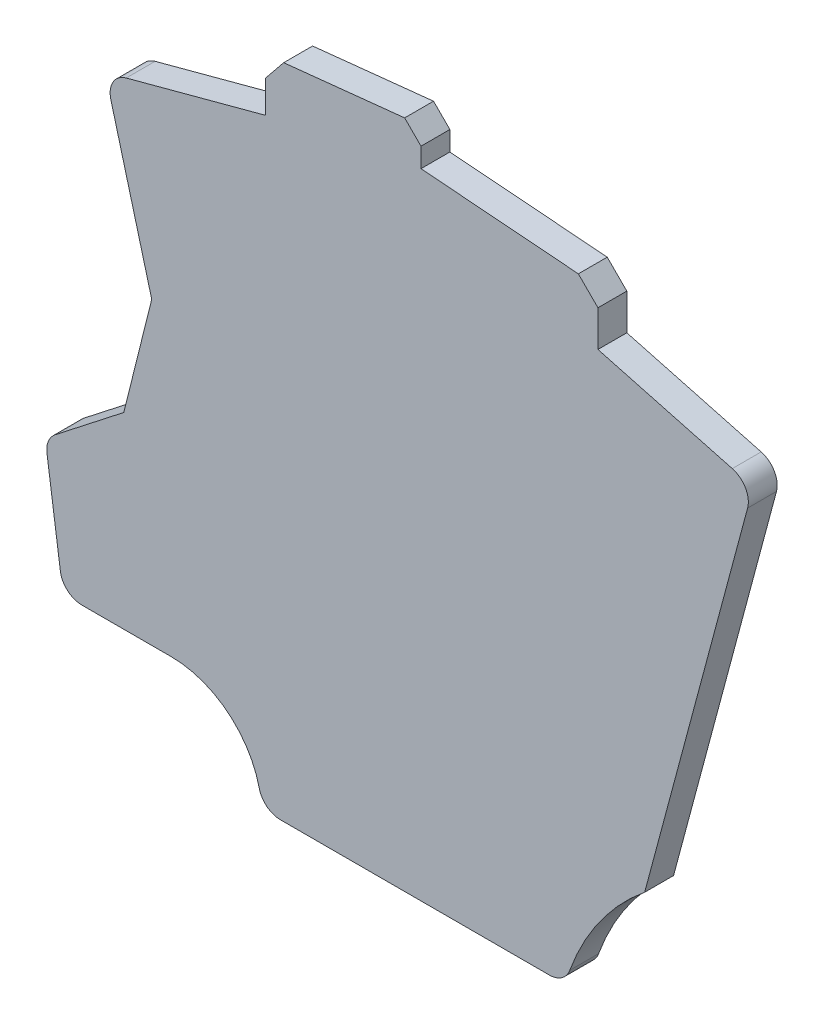
ISO-10303-21;
HEADER;
FILE_DESCRIPTION(('STEP AP214'),'2;1');
FILE_NAME('part.step','',(''),(''),'','','');
FILE_SCHEMA(('AUTOMOTIVE_DESIGN { 1 0 10303 214 1 1 1 1 }'));
ENDSEC;
DATA;
#1=APPLICATION_CONTEXT('core data for automotive mechanical design processes');
#2=APPLICATION_PROTOCOL_DEFINITION('international standard','automotive_design',2000,#1);
#3=PRODUCT_CONTEXT('',#1,'mechanical');
#4=PRODUCT('Part','Part','',(#3));
#5=PRODUCT_RELATED_PRODUCT_CATEGORY('part','',(#4));
#6=PRODUCT_DEFINITION_FORMATION('','',#4);
#7=PRODUCT_DEFINITION_CONTEXT('part definition',#1,'design');
#8=PRODUCT_DEFINITION('design','',#6,#7);
#9=PRODUCT_DEFINITION_SHAPE('','',#8);
#10=(LENGTH_UNIT() NAMED_UNIT(*) SI_UNIT(.MILLI.,.METRE.));
#11=(NAMED_UNIT(*) PLANE_ANGLE_UNIT() SI_UNIT($,.RADIAN.));
#12=(NAMED_UNIT(*) SI_UNIT($,.STERADIAN.) SOLID_ANGLE_UNIT());
#13=UNCERTAINTY_MEASURE_WITH_UNIT(LENGTH_MEASURE(1.E-05),#10,'distance_accuracy_value','');
#14=(GEOMETRIC_REPRESENTATION_CONTEXT(3) GLOBAL_UNCERTAINTY_ASSIGNED_CONTEXT((#13)) GLOBAL_UNIT_ASSIGNED_CONTEXT((#10,
#11,#12)) REPRESENTATION_CONTEXT('',''));
#15=CARTESIAN_POINT('',(0.,0.,0.));
#16=DIRECTION('',(0.,0.,1.));
#17=DIRECTION('',(1.,0.,0.));
#18=AXIS2_PLACEMENT_3D('',#15,#16,#17);
#19=CARTESIAN_POINT('',(-72.6098773719543,-55.173282531429,4.));
#20=DIRECTION('',(0.,0.,-1.));
#21=DIRECTION('',(-1.,0.,0.));
#22=AXIS2_PLACEMENT_3D('',#19,#20,#21);
#23=CYLINDRICAL_SURFACE('',#22,33.5);
#24=CARTESIAN_POINT('',(-72.6098773719543,-55.173282531429,4.));
#25=DIRECTION('',(0.,0.,1.));
#26=DIRECTION('',(1.,0.,0.));
#27=AXIS2_PLACEMENT_3D('',#24,#25,#26);
#28=CIRCLE('',#27,33.5);
#29=CARTESIAN_POINT('',(-93.7053912566705,-29.1496530009475,4.));
#30=VERTEX_POINT('',#29);
#31=CARTESIAN_POINT('',(-104.084142834018,-43.700679791703,4.));
#32=VERTEX_POINT('',#31);
#33=EDGE_CURVE('E232',#30,#32,#28,.T.);
#34=ORIENTED_EDGE('',*,*,#33,.T.);
#35=DIRECTION('',(0.,0.,-1.));
#36=VECTOR('',#35,1.);
#37=CARTESIAN_POINT('',(-104.084142834018,-43.700679791703,4.));
#38=LINE('',#37,#36);
#39=CARTESIAN_POINT('',(-104.084142834018,-43.700679791703,0.));
#40=VERTEX_POINT('',#39);
#41=EDGE_CURVE('E445',#32,#40,#38,.T.);
#42=ORIENTED_EDGE('',*,*,#41,.T.);
#43=CARTESIAN_POINT('',(-72.6098773719543,-55.173282531429,0.));
#44=DIRECTION('',(0.,0.,1.));
#45=DIRECTION('',(1.,0.,0.));
#46=AXIS2_PLACEMENT_3D('',#43,#44,#45);
#47=CIRCLE('',#46,33.5);
#48=CARTESIAN_POINT('',(-93.7053912566705,-29.1496530009475,0.));
#49=VERTEX_POINT('',#48);
#50=EDGE_CURVE('E239',#49,#40,#47,.T.);
#51=ORIENTED_EDGE('',*,*,#50,.F.);
#52=DIRECTION('',(0.,0.,-1.));
#53=VECTOR('',#52,1.);
#54=CARTESIAN_POINT('',(-93.7053912566705,-29.1496530009475,4.));
#55=LINE('',#54,#53);
#56=EDGE_CURVE('E224',#30,#49,#55,.T.);
#57=ORIENTED_EDGE('',*,*,#56,.F.);
#58=EDGE_LOOP('',(#34,#42,#51,#57));
#59=FACE_BOUND('',#58,.T.);
#60=ADVANCED_FACE('F49',(#59),#23,.F.);
#61=CARTESIAN_POINT('',(-80.1409070280172,21.4736913188545,4.));
#62=DIRECTION('',(0.96592582628907,-0.258819045102516,0.));
#63=DIRECTION('',(0.258819045102516,0.96592582628907,0.));
#64=AXIS2_PLACEMENT_3D('',#61,#62,#63);
#65=PLANE('',#64);
#66=DIRECTION('',(-0.258819045102516,-0.96592582628907,0.));
#67=VECTOR('',#66,1.);
#68=CARTESIAN_POINT('',(-80.1409070280172,21.4736913188545,0.));
#69=LINE('',#68,#67);
#70=CARTESIAN_POINT('',(-79.4509586221637,24.0486138241009,0.));
#71=VERTEX_POINT('',#70);
#72=EDGE_CURVE('E308',#71,#49,#69,.T.);
#73=ORIENTED_EDGE('',*,*,#72,.F.);
#74=DIRECTION('',(0.,0.,-1.));
#75=VECTOR('',#74,1.);
#76=CARTESIAN_POINT('',(-79.4509586221637,24.0486138241009,4.));
#77=LINE('',#76,#75);
#78=CARTESIAN_POINT('',(-79.4509586221637,24.0486138241009,4.));
#79=VERTEX_POINT('',#78);
#80=EDGE_CURVE('E227',#71,#79,#77,.F.);
#81=ORIENTED_EDGE('',*,*,#80,.T.);
#82=DIRECTION('',(-0.258819045102516,-0.96592582628907,0.));
#83=VECTOR('',#82,1.);
#84=CARTESIAN_POINT('',(-80.1409070280172,21.4736913188545,4.));
#85=LINE('',#84,#83);
#86=EDGE_CURVE('E220',#79,#30,#85,.T.);
#87=ORIENTED_EDGE('',*,*,#86,.T.);
#88=ORIENTED_EDGE('',*,*,#56,.T.);
#89=EDGE_LOOP('',(#73,#81,#87,#88));
#90=FACE_BOUND('',#89,.T.);
#91=ADVANCED_FACE('F223',(#90),#65,.T.);
#92=CARTESIAN_POINT('',(1.46640554116103,5.4726999841136,4.));
#93=DIRECTION('',(0.258819045102516,0.96592582628907,0.));
#94=DIRECTION('',(-0.96592582628907,0.258819045102516,0.));
#95=AXIS2_PLACEMENT_3D('',#92,#93,#94);
#96=PLANE('',#95);
#97=DIRECTION('',(0.96592582628907,-0.258819045102516,0.));
#98=VECTOR('',#97,1.);
#99=CARTESIAN_POINT('',(1.46640554116103,5.4726999841136,4.));
#100=LINE('',#99,#98);
#101=CARTESIAN_POINT('',(-100.174501486856,32.7072989402371,4.));
#102=VERTEX_POINT('',#101);
#103=CARTESIAN_POINT('',(-81.5722789657233,27.7228484382756,4.));
#104=VERTEX_POINT('',#103);
#105=EDGE_CURVE('E231',#102,#104,#100,.T.);
#106=ORIENTED_EDGE('',*,*,#105,.T.);
#107=DIRECTION('',(0.,0.,-1.));
#108=VECTOR('',#107,1.);
#109=CARTESIAN_POINT('',(-81.5722789657233,27.7228484382756,4.));
#110=LINE('',#109,#108);
#111=CARTESIAN_POINT('',(-81.5722789657233,27.7228484382756,0.));
#112=VERTEX_POINT('',#111);
#113=EDGE_CURVE('E422',#104,#112,#110,.T.);
#114=ORIENTED_EDGE('',*,*,#113,.T.);
#115=DIRECTION('',(0.96592582628907,-0.258819045102516,0.));
#116=VECTOR('',#115,1.);
#117=CARTESIAN_POINT('',(1.46640554116103,5.4726999841136,0.));
#118=LINE('',#117,#116);
#119=CARTESIAN_POINT('',(-100.174501486856,32.7072989402371,0.));
#120=VERTEX_POINT('',#119);
#121=EDGE_CURVE('E311',#120,#112,#118,.T.);
#122=ORIENTED_EDGE('',*,*,#121,.F.);
#123=DIRECTION('',(0.,0.,-1.));
#124=VECTOR('',#123,1.);
#125=CARTESIAN_POINT('',(-100.174501486856,32.7072989402371,4.));
#126=LINE('',#125,#124);
#127=EDGE_CURVE('E242',#102,#120,#126,.T.);
#128=ORIENTED_EDGE('',*,*,#127,.F.);
#129=EDGE_LOOP('',(#106,#114,#122,#128));
#130=FACE_BOUND('',#129,.T.);
#131=ADVANCED_FACE('F577',(#130),#96,.T.);
#132=CARTESIAN_POINT('',(-100.174501486856,-3.70720126770182E-13,4.));
#133=DIRECTION('',(1.,0.,0.));
#134=DIRECTION('',(0.,1.,0.));
#135=AXIS2_PLACEMENT_3D('',#132,#133,#134);
#136=PLANE('',#135);
#137=DIRECTION('',(0.,-1.,0.));
#138=VECTOR('',#137,1.);
#139=CARTESIAN_POINT('',(-100.174501486856,-3.70720126770182E-13,0.));
#140=LINE('',#139,#138);
#141=CARTESIAN_POINT('',(-100.174501486856,37.7072989402371,0.));
#142=VERTEX_POINT('',#141);
#143=EDGE_CURVE('E315',#142,#120,#140,.T.);
#144=ORIENTED_EDGE('',*,*,#143,.F.);
#145=DIRECTION('',(0.,0.,1.));
#146=VECTOR('',#145,1.);
#147=CARTESIAN_POINT('',(-100.174501486856,37.7072989402371,4.));
#148=LINE('',#147,#146);
#149=CARTESIAN_POINT('',(-100.174501486856,37.7072989402371,4.));
#150=VERTEX_POINT('',#149);
#151=EDGE_CURVE('E11',#142,#150,#148,.T.);
#152=ORIENTED_EDGE('',*,*,#151,.T.);
#153=DIRECTION('',(0.,-1.,0.));
#154=VECTOR('',#153,1.);
#155=CARTESIAN_POINT('',(-100.174501486856,-3.70720126770182E-13,4.));
#156=LINE('',#155,#154);
#157=EDGE_CURVE('E260',#150,#102,#156,.T.);
#158=ORIENTED_EDGE('',*,*,#157,.T.);
#159=ORIENTED_EDGE('',*,*,#127,.T.);
#160=EDGE_LOOP('',(#144,#152,#158,#159));
#161=FACE_BOUND('',#160,.T.);
#162=ADVANCED_FACE('F616',(#161),#136,.T.);
#163=CARTESIAN_POINT('',(2.52824647853453,32.1244173797856,4.));
#164=DIRECTION('',(0.078459095727813,0.996917333733131,0.));
#165=DIRECTION('',(-0.996917333733131,0.078459095727813,0.));
#166=AXIS2_PLACEMENT_3D('',#163,#164,#165);
#167=PLANE('',#166);
#168=DIRECTION('',(0.996917333733131,-0.078459095727813,0.));
#169=VECTOR('',#168,1.);
#170=CARTESIAN_POINT('',(2.52824647853453,32.1244173797856,4.));
#171=LINE('',#170,#169);
#172=CARTESIAN_POINT('',(-124.674501486856,42.1354907574395,4.));
#173=VERTEX_POINT('',#172);
#174=CARTESIAN_POINT('',(-102.888063444497,40.4208608978777,4.));
#175=VERTEX_POINT('',#174);
#176=EDGE_CURVE('E263',#173,#175,#171,.T.);
#177=ORIENTED_EDGE('',*,*,#176,.T.);
#178=DIRECTION('',(0.,0.,-1.));
#179=VECTOR('',#178,1.);
#180=CARTESIAN_POINT('',(-102.888063444497,40.4208608978777,4.));
#181=LINE('',#180,#179);
#182=CARTESIAN_POINT('',(-102.888063444497,40.4208608978777,0.));
#183=VERTEX_POINT('',#182);
#184=EDGE_CURVE('E59',#175,#183,#181,.T.);
#185=ORIENTED_EDGE('',*,*,#184,.T.);
#186=DIRECTION('',(0.996917333733131,-0.078459095727813,0.));
#187=VECTOR('',#186,1.);
#188=CARTESIAN_POINT('',(2.52824647853453,32.1244173797856,0.));
#189=LINE('',#188,#187);
#190=CARTESIAN_POINT('',(-124.674501486856,42.1354907574395,0.));
#191=VERTEX_POINT('',#190);
#192=EDGE_CURVE('E318',#191,#183,#189,.T.);
#193=ORIENTED_EDGE('',*,*,#192,.F.);
#194=DIRECTION('',(0.,0.,-1.));
#195=VECTOR('',#194,1.);
#196=CARTESIAN_POINT('',(-124.674501486856,42.1354907574395,4.));
#197=LINE('',#196,#195);
#198=EDGE_CURVE('E371',#173,#191,#197,.T.);
#199=ORIENTED_EDGE('',*,*,#198,.F.);
#200=EDGE_LOOP('',(#177,#185,#193,#199));
#201=FACE_BOUND('',#200,.T.);
#202=ADVANCED_FACE('F486',(#201),#167,.T.);
#203=CARTESIAN_POINT('',(-124.674501486857,1.33092790513819E-12,4.));
#204=DIRECTION('',(1.,0.,0.));
#205=DIRECTION('',(0.,1.,0.));
#206=AXIS2_PLACEMENT_3D('',#203,#204,#205);
#207=PLANE('',#206);
#208=DIRECTION('',(0.,-1.,0.));
#209=VECTOR('',#208,1.);
#210=CARTESIAN_POINT('',(-124.674501486857,1.33092790513819E-12,0.));
#211=LINE('',#210,#209);
#212=CARTESIAN_POINT('',(-124.674501486856,44.8354907574394,0.));
#213=VERTEX_POINT('',#212);
#214=EDGE_CURVE('E322',#213,#191,#211,.T.);
#215=ORIENTED_EDGE('',*,*,#214,.F.);
#216=DIRECTION('',(0.,0.,1.));
#217=VECTOR('',#216,1.);
#218=CARTESIAN_POINT('',(-124.674501486856,44.8354907574394,4.));
#219=LINE('',#218,#217);
#220=CARTESIAN_POINT('',(-124.674501486856,44.8354907574394,4.));
#221=VERTEX_POINT('',#220);
#222=EDGE_CURVE('E66',#213,#221,#219,.T.);
#223=ORIENTED_EDGE('',*,*,#222,.T.);
#224=DIRECTION('',(0.,-1.,0.));
#225=VECTOR('',#224,1.);
#226=CARTESIAN_POINT('',(-124.674501486857,1.33092790513819E-12,4.));
#227=LINE('',#226,#225);
#228=EDGE_CURVE('E266',#221,#173,#227,.T.);
#229=ORIENTED_EDGE('',*,*,#228,.T.);
#230=ORIENTED_EDGE('',*,*,#198,.T.);
#231=EDGE_LOOP('',(#215,#223,#229,#230));
#232=FACE_BOUND('',#231,.T.);
#233=ADVANCED_FACE('F492',(#232),#207,.T.);
#234=CARTESIAN_POINT('',(-6.27037794897112,59.7593063952665,4.));
#235=DIRECTION('',(-0.104354337399525,0.99454018132296,0.));
#236=DIRECTION('',(-0.99454018132296,-0.104354337399525,0.));
#237=AXIS2_PLACEMENT_3D('',#234,#235,#236);
#238=PLANE('',#237);
#239=DIRECTION('',(0.99454018132296,0.104354337399525,0.));
#240=VECTOR('',#239,1.);
#241=CARTESIAN_POINT('',(-6.27037794897112,59.7593063952665,0.));
#242=LINE('',#241,#240);
#243=CARTESIAN_POINT('',(-143.688151033549,45.3404413494281,0.));
#244=VERTEX_POINT('',#243);
#245=CARTESIAN_POINT('',(-126.937093947685,47.0980832182681,0.));
#246=VERTEX_POINT('',#245);
#247=EDGE_CURVE('E325',#244,#246,#242,.T.);
#248=ORIENTED_EDGE('',*,*,#247,.F.);
#249=DIRECTION('',(0.,0.,1.));
#250=VECTOR('',#249,1.);
#251=CARTESIAN_POINT('',(-143.688151033549,45.3404413494281,4.));
#252=LINE('',#251,#250);
#253=CARTESIAN_POINT('',(-143.688151033549,45.3404413494281,4.));
#254=VERTEX_POINT('',#253);
#255=EDGE_CURVE('E469',#244,#254,#252,.T.);
#256=ORIENTED_EDGE('',*,*,#255,.T.);
#257=DIRECTION('',(0.99454018132296,0.104354337399525,0.));
#258=VECTOR('',#257,1.);
#259=CARTESIAN_POINT('',(-6.27037794897112,59.7593063952665,4.));
#260=LINE('',#259,#258);
#261=CARTESIAN_POINT('',(-126.937093947685,47.0980832182681,4.));
#262=VERTEX_POINT('',#261);
#263=EDGE_CURVE('E269',#254,#262,#260,.T.);
#264=ORIENTED_EDGE('',*,*,#263,.T.);
#265=DIRECTION('',(0.,0.,-1.));
#266=VECTOR('',#265,1.);
#267=CARTESIAN_POINT('',(-126.937093947685,47.0980832182681,4.));
#268=LINE('',#267,#266);
#269=EDGE_CURVE('E465',#262,#246,#268,.T.);
#270=ORIENTED_EDGE('',*,*,#269,.T.);
#271=EDGE_LOOP('',(#248,#256,#264,#270));
#272=FACE_BOUND('',#271,.T.);
#273=ADVANCED_FACE('F499',(#272),#238,.T.);
#274=CARTESIAN_POINT('',(-146.174501486856,-2.2230999611481E-12,4.));
#275=DIRECTION('',(-1.,0.,0.));
#276=DIRECTION('',(0.,-1.,0.));
#277=AXIS2_PLACEMENT_3D('',#274,#275,#276);
#278=PLANE('',#277);
#279=DIRECTION('',(0.,1.,0.));
#280=VECTOR('',#279,1.);
#281=CARTESIAN_POINT('',(-146.174501486856,-2.2230999611481E-12,4.));
#282=LINE('',#281,#280);
#283=CARTESIAN_POINT('',(-146.174501486856,37.7795555059293,4.));
#284=VERTEX_POINT('',#283);
#285=CARTESIAN_POINT('',(-146.174501486856,42.2711531739158,4.));
#286=VERTEX_POINT('',#285);
#287=EDGE_CURVE('E273',#284,#286,#282,.T.);
#288=ORIENTED_EDGE('',*,*,#287,.T.);
#289=DIRECTION('',(0.,0.,-1.));
#290=VECTOR('',#289,1.);
#291=CARTESIAN_POINT('',(-146.174501486856,42.2711531739158,4.));
#292=LINE('',#291,#290);
#293=CARTESIAN_POINT('',(-146.174501486856,42.2711531739158,0.));
#294=VERTEX_POINT('',#293);
#295=EDGE_CURVE('E452',#286,#294,#292,.T.);
#296=ORIENTED_EDGE('',*,*,#295,.T.);
#297=DIRECTION('',(0.,1.,0.));
#298=VECTOR('',#297,1.);
#299=CARTESIAN_POINT('',(-146.174501486856,-2.2230999611481E-12,0.));
#300=LINE('',#299,#298);
#301=CARTESIAN_POINT('',(-146.174501486856,37.7795555059293,0.));
#302=VERTEX_POINT('',#301);
#303=EDGE_CURVE('E329',#302,#294,#300,.T.);
#304=ORIENTED_EDGE('',*,*,#303,.F.);
#305=DIRECTION('',(0.,0.,-1.));
#306=VECTOR('',#305,1.);
#307=CARTESIAN_POINT('',(-146.174501486856,37.7795555059293,4.));
#308=LINE('',#307,#306);
#309=EDGE_CURVE('E367',#284,#302,#308,.T.);
#310=ORIENTED_EDGE('',*,*,#309,.F.);
#311=EDGE_LOOP('',(#288,#296,#304,#310));
#312=FACE_BOUND('',#311,.T.);
#313=ADVANCED_FACE('F507',(#312),#278,.T.);
#314=CARTESIAN_POINT('',(-19.2367237833399,71.7924305305896,4.));
#315=DIRECTION('',(-0.258819045102533,0.965925826289065,0.));
#316=DIRECTION('',(-0.965925826289065,-0.258819045102533,0.));
#317=AXIS2_PLACEMENT_3D('',#314,#315,#316);
#318=PLANE('',#317);
#319=DIRECTION('',(0.965925826289065,0.258819045102533,0.));
#320=VECTOR('',#319,1.);
#321=CARTESIAN_POINT('',(-19.2367237833399,71.7924305305896,0.));
#322=LINE('',#321,#320);
#323=CARTESIAN_POINT('',(-165.493018012638,32.6031746038786,0.));
#324=VERTEX_POINT('',#323);
#325=EDGE_CURVE('E333',#324,#302,#322,.T.);
#326=ORIENTED_EDGE('',*,*,#325,.F.);
#327=DIRECTION('',(0.,0.,-1.));
#328=VECTOR('',#327,1.);
#329=CARTESIAN_POINT('',(-165.493018012638,32.6031746038786,4.));
#330=LINE('',#329,#328);
#331=CARTESIAN_POINT('',(-165.493018012638,32.6031746038786,4.));
#332=VERTEX_POINT('',#331);
#333=EDGE_CURVE('E432',#324,#332,#330,.F.);
#334=ORIENTED_EDGE('',*,*,#333,.T.);
#335=DIRECTION('',(0.965925826289065,0.258819045102533,0.));
#336=VECTOR('',#335,1.);
#337=CARTESIAN_POINT('',(-19.2367237833399,71.7924305305896,4.));
#338=LINE('',#337,#336);
#339=EDGE_CURVE('E277',#332,#284,#338,.T.);
#340=ORIENTED_EDGE('',*,*,#339,.T.);
#341=ORIENTED_EDGE('',*,*,#309,.T.);
#342=EDGE_LOOP('',(#326,#334,#340,#341));
#343=FACE_BOUND('',#342,.T.);
#344=ADVANCED_FACE('F660',(#343),#318,.T.);
#345=CARTESIAN_POINT('',(-149.154071708165,-39.9657130620186,4.));
#346=DIRECTION('',(-0.965925826289065,-0.258819045102534,0.));
#347=DIRECTION('',(0.258819045102534,-0.965925826289065,0.));
#348=AXIS2_PLACEMENT_3D('',#345,#346,#347);
#349=PLANE('',#348);
#350=DIRECTION('',(-0.258819045102534,0.965925826289065,0.));
#351=VECTOR('',#350,1.);
#352=CARTESIAN_POINT('',(-149.154071708165,-39.9657130620186,4.));
#353=LINE('',#352,#351);
#354=CARTESIAN_POINT('',(-161.960014873157,7.82671746857102,4.));
#355=VERTEX_POINT('',#354);
#356=CARTESIAN_POINT('',(-167.614338356197,28.9289399897038,4.));
#357=VERTEX_POINT('',#356);
#358=EDGE_CURVE('E280',#355,#357,#353,.T.);
#359=ORIENTED_EDGE('',*,*,#358,.T.);
#360=DIRECTION('',(0.,0.,-1.));
#361=VECTOR('',#360,1.);
#362=CARTESIAN_POINT('',(-167.614338356197,28.9289399897038,4.));
#363=LINE('',#362,#361);
#364=CARTESIAN_POINT('',(-167.614338356197,28.9289399897038,0.));
#365=VERTEX_POINT('',#364);
#366=EDGE_CURVE('E428',#357,#365,#363,.T.);
#367=ORIENTED_EDGE('',*,*,#366,.T.);
#368=DIRECTION('',(-0.258819045102534,0.965925826289065,0.));
#369=VECTOR('',#368,1.);
#370=CARTESIAN_POINT('',(-149.154071708165,-39.9657130620186,0.));
#371=LINE('',#370,#369);
#372=CARTESIAN_POINT('',(-161.960014873157,7.82671746857102,0.));
#373=VERTEX_POINT('',#372);
#374=EDGE_CURVE('E336',#373,#365,#371,.T.);
#375=ORIENTED_EDGE('',*,*,#374,.F.);
#376=DIRECTION('',(0.,0.,-1.));
#377=VECTOR('',#376,1.);
#378=CARTESIAN_POINT('',(-161.960014873157,7.82671746857102,4.));
#379=LINE('',#378,#377);
#380=EDGE_CURVE('E364',#355,#373,#379,.T.);
#381=ORIENTED_EDGE('',*,*,#380,.F.);
#382=EDGE_LOOP('',(#359,#367,#375,#381));
#383=FACE_BOUND('',#382,.T.);
#384=ADVANCED_FACE('F520',(#383),#349,.T.);
#385=CARTESIAN_POINT('',(-154.318320713132,38.4758787055164,4.));
#386=DIRECTION('',(-0.970295726276,0.241921895599655,0.));
#387=DIRECTION('',(-0.241921895599655,-0.970295726276,0.));
#388=AXIS2_PLACEMENT_3D('',#385,#386,#387);
#389=PLANE('',#388);
#390=DIRECTION('',(0.241921895599655,0.970295726276,0.));
#391=VECTOR('',#390,1.);
#392=CARTESIAN_POINT('',(-154.318320713132,38.4758787055164,0.));
#393=LINE('',#392,#391);
#394=CARTESIAN_POINT('',(-165.824598917227,-7.673282531429,0.));
#395=VERTEX_POINT('',#394);
#396=EDGE_CURVE('E340',#395,#373,#393,.T.);
#397=ORIENTED_EDGE('',*,*,#396,.F.);
#398=DIRECTION('',(0.,0.,-1.));
#399=VECTOR('',#398,1.);
#400=CARTESIAN_POINT('',(-165.824598917227,-7.673282531429,4.));
#401=LINE('',#400,#399);
#402=CARTESIAN_POINT('',(-165.824598917227,-7.673282531429,4.));
#403=VERTEX_POINT('',#402);
#404=EDGE_CURVE('E360',#403,#395,#401,.T.);
#405=ORIENTED_EDGE('',*,*,#404,.F.);
#406=DIRECTION('',(0.241921895599655,0.970295726276,0.));
#407=VECTOR('',#406,1.);
#408=CARTESIAN_POINT('',(-154.318320713132,38.4758787055164,4.));
#409=LINE('',#408,#407);
#410=EDGE_CURVE('E284',#403,#355,#409,.T.);
#411=ORIENTED_EDGE('',*,*,#410,.T.);
#412=ORIENTED_EDGE('',*,*,#380,.T.);
#413=EDGE_LOOP('',(#397,#405,#411,#412));
#414=FACE_BOUND('',#413,.T.);
#415=ADVANCED_FACE('F526',(#414),#389,.T.);
#416=CARTESIAN_POINT('',(-59.1313221816829,75.6846410269565,4.));
#417=DIRECTION('',(-0.615661475325666,0.788010753606716,0.));
#418=DIRECTION('',(-0.788010753606716,-0.615661475325666,0.));
#419=AXIS2_PLACEMENT_3D('',#416,#417,#418);
#420=PLANE('',#419);
#421=DIRECTION('',(0.788010753606716,0.615661475325666,0.));
#422=VECTOR('',#421,1.);
#423=CARTESIAN_POINT('',(-59.1313221816829,75.6846410269565,0.));
#424=LINE('',#423,#422);
#425=CARTESIAN_POINT('',(-175.33922812871,-15.1069255759022,0.));
#426=VERTEX_POINT('',#425);
#427=EDGE_CURVE('E344',#426,#395,#424,.T.);
#428=ORIENTED_EDGE('',*,*,#427,.F.);
#429=DIRECTION('',(0.,0.,-1.));
#430=VECTOR('',#429,1.);
#431=CARTESIAN_POINT('',(-175.33922812871,-15.1069255759022,4.));
#432=LINE('',#431,#430);
#433=CARTESIAN_POINT('',(-175.33922812871,-15.1069255759022,4.));
#434=VERTEX_POINT('',#433);
#435=EDGE_CURVE('E442',#426,#434,#432,.F.);
#436=ORIENTED_EDGE('',*,*,#435,.T.);
#437=DIRECTION('',(0.788010753606716,0.615661475325666,0.));
#438=VECTOR('',#437,1.);
#439=CARTESIAN_POINT('',(-59.1313221816829,75.6846410269565,4.));
#440=LINE('',#439,#438);
#441=EDGE_CURVE('E288',#434,#403,#440,.T.);
#442=ORIENTED_EDGE('',*,*,#441,.T.);
#443=ORIENTED_EDGE('',*,*,#404,.T.);
#444=EDGE_LOOP('',(#428,#436,#442,#443));
#445=FACE_BOUND('',#444,.T.);
#446=ADVANCED_FACE('F761',(#445),#420,.T.);
#447=CARTESIAN_POINT('',(-175.51047457536,-24.6663885958345,4.));
#448=DIRECTION('',(0.99026806874157,0.139173100960069,0.));
#449=DIRECTION('',(-0.139173100960069,0.99026806874157,0.));
#450=AXIS2_PLACEMENT_3D('',#447,#448,#449);
#451=PLANE('',#450);
#452=DIRECTION('',(0.139173100960069,-0.99026806874157,0.));
#453=VECTOR('',#452,1.);
#454=CARTESIAN_POINT('',(-175.51047457536,-24.6663885958345,4.));
#455=LINE('',#454,#453);
#456=CARTESIAN_POINT('',(-176.463047908958,-17.8884771396025,4.));
#457=VERTEX_POINT('',#456);
#458=CARTESIAN_POINT('',(-174.607582176352,-31.0908018343092,4.));
#459=VERTEX_POINT('',#458);
#460=EDGE_CURVE('E291',#457,#459,#455,.T.);
#461=ORIENTED_EDGE('',*,*,#460,.F.);
#462=DIRECTION('',(0.,0.,-1.));
#463=VECTOR('',#462,1.);
#464=CARTESIAN_POINT('',(-176.463047908958,-17.8884771396025,0.));
#465=LINE('',#464,#463);
#466=CARTESIAN_POINT('',(-176.463047908958,-17.8884771396025,0.));
#467=VERTEX_POINT('',#466);
#468=EDGE_CURVE('E438',#457,#467,#465,.T.);
#469=ORIENTED_EDGE('',*,*,#468,.T.);
#470=DIRECTION('',(0.139173100960069,-0.99026806874157,0.));
#471=VECTOR('',#470,1.);
#472=CARTESIAN_POINT('',(-175.51047457536,-24.6663885958345,0.));
#473=LINE('',#472,#471);
#474=CARTESIAN_POINT('',(-174.607582176352,-31.0908018343092,0.));
#475=VERTEX_POINT('',#474);
#476=EDGE_CURVE('E347',#467,#475,#473,.T.);
#477=ORIENTED_EDGE('',*,*,#476,.T.);
#478=DIRECTION('',(0.,0.,-1.));
#479=VECTOR('',#478,1.);
#480=CARTESIAN_POINT('',(-174.607582176352,-31.0908018343092,4.));
#481=LINE('',#480,#479);
#482=EDGE_CURVE('E435',#475,#459,#481,.F.);
#483=ORIENTED_EDGE('',*,*,#482,.T.);
#484=EDGE_LOOP('',(#461,#469,#477,#483));
#485=FACE_BOUND('',#484,.T.);
#486=ADVANCED_FACE('F538',(#485),#451,.F.);
#487=CARTESIAN_POINT('',(0.,-33.673282531429,4.));
#488=DIRECTION('',(0.,-1.,0.));
#489=DIRECTION('',(0.,0.,-1.));
#490=AXIS2_PLACEMENT_3D('',#487,#488,#489);
#491=PLANE('',#490);
#492=DIRECTION('',(-1.,0.,0.));
#493=VECTOR('',#492,1.);
#494=CARTESIAN_POINT('',(0.,-33.673282531429,4.));
#495=LINE('',#494,#493);
#496=CARTESIAN_POINT('',(-159.244638183576,-33.673282531429,4.));
#497=VERTEX_POINT('',#496);
#498=CARTESIAN_POINT('',(-171.636777970127,-33.673282531429,4.));
#499=VERTEX_POINT('',#498);
#500=EDGE_CURVE('E295',#497,#499,#495,.T.);
#501=ORIENTED_EDGE('',*,*,#500,.T.);
#502=DIRECTION('',(0.,0.,-1.));
#503=VECTOR('',#502,1.);
#504=CARTESIAN_POINT('',(-171.636777970127,-33.673282531429,0.));
#505=LINE('',#504,#503);
#506=CARTESIAN_POINT('',(-171.636777970127,-33.673282531429,0.));
#507=VERTEX_POINT('',#506);
#508=EDGE_CURVE('E448',#499,#507,#505,.T.);
#509=ORIENTED_EDGE('',*,*,#508,.T.);
#510=DIRECTION('',(-1.,0.,0.));
#511=VECTOR('',#510,1.);
#512=CARTESIAN_POINT('',(0.,-33.673282531429,0.));
#513=LINE('',#512,#511);
#514=CARTESIAN_POINT('',(-159.244638183576,-33.673282531429,0.));
#515=VERTEX_POINT('',#514);
#516=EDGE_CURVE('E351',#515,#507,#513,.T.);
#517=ORIENTED_EDGE('',*,*,#516,.F.);
#518=DIRECTION('',(0.,0.,-1.));
#519=VECTOR('',#518,1.);
#520=CARTESIAN_POINT('',(-159.244638183576,-33.673282531429,4.));
#521=LINE('',#520,#519);
#522=EDGE_CURVE('E305',#497,#515,#521,.T.);
#523=ORIENTED_EDGE('',*,*,#522,.F.);
#524=EDGE_LOOP('',(#501,#509,#517,#523));
#525=FACE_BOUND('',#524,.T.);
#526=ADVANCED_FACE('F546',(#525),#491,.T.);
#527=CARTESIAN_POINT('',(-159.244638183576,-46.173282531429,4.));
#528=DIRECTION('',(0.,0.,-1.));
#529=DIRECTION('',(-1.,0.,0.));
#530=AXIS2_PLACEMENT_3D('',#527,#528,#529);
#531=CYLINDRICAL_SURFACE('',#530,12.5);
#532=CARTESIAN_POINT('',(-159.244638183576,-46.173282531429,0.));
#533=DIRECTION('',(0.,0.,1.));
#534=DIRECTION('',(1.,0.,0.));
#535=AXIS2_PLACEMENT_3D('',#532,#533,#534);
#536=CIRCLE('',#535,12.5);
#537=CARTESIAN_POINT('',(-147.067485868623,-43.3507018862677,0.));
#538=VERTEX_POINT('',#537);
#539=EDGE_CURVE('E254',#538,#515,#536,.T.);
#540=ORIENTED_EDGE('',*,*,#539,.F.);
#541=DIRECTION('',(0.,0.,-1.));
#542=VECTOR('',#541,1.);
#543=CARTESIAN_POINT('',(-147.067485868623,-43.3507018862677,4.));
#544=LINE('',#543,#542);
#545=CARTESIAN_POINT('',(-147.067485868623,-43.3507018862677,4.));
#546=VERTEX_POINT('',#545);
#547=EDGE_CURVE('E402',#538,#546,#544,.F.);
#548=ORIENTED_EDGE('',*,*,#547,.T.);
#549=CARTESIAN_POINT('',(-159.244638183576,-46.173282531429,4.));
#550=DIRECTION('',(0.,0.,1.));
#551=DIRECTION('',(1.,0.,0.));
#552=AXIS2_PLACEMENT_3D('',#549,#550,#551);
#553=CIRCLE('',#552,12.5);
#554=EDGE_CURVE('E299',#546,#497,#553,.T.);
#555=ORIENTED_EDGE('',*,*,#554,.T.);
#556=ORIENTED_EDGE('',*,*,#522,.T.);
#557=EDGE_LOOP('',(#540,#548,#555,#556));
#558=FACE_BOUND('',#557,.T.);
#559=ADVANCED_FACE('F736',(#558),#531,.F.);
#560=CARTESIAN_POINT('',(0.,-45.673282531429,4.));
#561=DIRECTION('',(0.,1.,0.));
#562=DIRECTION('',(-1.,0.,0.));
#563=AXIS2_PLACEMENT_3D('',#560,#561,#562);
#564=PLANE('',#563);
#565=DIRECTION('',(1.,0.,0.));
#566=VECTOR('',#565,1.);
#567=CARTESIAN_POINT('',(0.,-45.673282531429,4.));
#568=LINE('',#567,#566);
#569=CARTESIAN_POINT('',(-144.144969313034,-45.673282531429,4.));
#570=VERTEX_POINT('',#569);
#571=CARTESIAN_POINT('',(-106.902733770919,-45.673282531429,4.));
#572=VERTEX_POINT('',#571);
#573=EDGE_CURVE('E302',#570,#572,#568,.T.);
#574=ORIENTED_EDGE('',*,*,#573,.F.);
#575=DIRECTION('',(0.,0.,1.));
#576=VECTOR('',#575,1.);
#577=CARTESIAN_POINT('',(-144.144969313034,-45.673282531429,0.));
#578=LINE('',#577,#576);
#579=CARTESIAN_POINT('',(-144.144969313034,-45.673282531429,0.));
#580=VERTEX_POINT('',#579);
#581=EDGE_CURVE('E380',#570,#580,#578,.F.);
#582=ORIENTED_EDGE('',*,*,#581,.T.);
#583=DIRECTION('',(1.,0.,0.));
#584=VECTOR('',#583,1.);
#585=CARTESIAN_POINT('',(0.,-45.673282531429,0.));
#586=LINE('',#585,#584);
#587=CARTESIAN_POINT('',(-106.902733770919,-45.673282531429,0.));
#588=VERTEX_POINT('',#587);
#589=EDGE_CURVE('E250',#580,#588,#586,.T.);
#590=ORIENTED_EDGE('',*,*,#589,.T.);
#591=DIRECTION('',(0.,0.,1.));
#592=VECTOR('',#591,1.);
#593=CARTESIAN_POINT('',(-106.902733770919,-45.673282531429,4.));
#594=LINE('',#593,#592);
#595=EDGE_CURVE('E241',#588,#572,#594,.T.);
#596=ORIENTED_EDGE('',*,*,#595,.T.);
#597=EDGE_LOOP('',(#574,#582,#590,#596));
#598=FACE_BOUND('',#597,.T.);
#599=ADVANCED_FACE('F559',(#598),#564,.F.);
#600=CARTESIAN_POINT('',(0.,0.,4.));
#601=DIRECTION('',(0.,0.,1.));
#602=DIRECTION('',(1.,0.,0.));
#603=AXIS2_PLACEMENT_3D('',#600,#601,#602);
#604=PLANE('',#603);
#605=ORIENTED_EDGE('',*,*,#263,.F.);
#606=DIRECTION('',(0.62945644675453,0.777035765997397,0.));
#607=VECTOR('',#606,1.);
#608=CARTESIAN_POINT('',(-108.933161237327,88.2439182425173,4.));
#609=LINE('',#608,#607);
#610=EDGE_CURVE('E477',#254,#286,#609,.F.);
#611=ORIENTED_EDGE('',*,*,#610,.T.);
#612=ORIENTED_EDGE('',*,*,#287,.F.);
#613=ORIENTED_EDGE('',*,*,#339,.F.);
#614=CARTESIAN_POINT('',(-164.71656087733,29.7053971250114,4.));
#615=DIRECTION('',(0.,0.,1.));
#616=DIRECTION('',(1.,0.,0.));
#617=AXIS2_PLACEMENT_3D('',#614,#615,#616);
#618=CIRCLE('',#617,3.);
#619=EDGE_CURVE('E413',#332,#357,#618,.T.);
#620=ORIENTED_EDGE('',*,*,#619,.T.);
#621=ORIENTED_EDGE('',*,*,#358,.F.);
#622=ORIENTED_EDGE('',*,*,#410,.F.);
#623=ORIENTED_EDGE('',*,*,#441,.F.);
#624=CARTESIAN_POINT('',(-173.492243702733,-17.4709578367223,4.));
#625=DIRECTION('',(0.,0.,1.));
#626=DIRECTION('',(1.,0.,0.));
#627=AXIS2_PLACEMENT_3D('',#624,#625,#626);
#628=CIRCLE('',#627,3.);
#629=EDGE_CURVE('E410',#434,#457,#628,.T.);
#630=ORIENTED_EDGE('',*,*,#629,.T.);
#631=ORIENTED_EDGE('',*,*,#460,.T.);
#632=CARTESIAN_POINT('',(-171.636777970127,-30.673282531429,4.));
#633=DIRECTION('',(0.,0.,1.));
#634=DIRECTION('',(1.,0.,0.));
#635=AXIS2_PLACEMENT_3D('',#632,#633,#634);
#636=CIRCLE('',#635,3.);
#637=EDGE_CURVE('E405',#459,#499,#636,.T.);
#638=ORIENTED_EDGE('',*,*,#637,.T.);
#639=ORIENTED_EDGE('',*,*,#500,.F.);
#640=ORIENTED_EDGE('',*,*,#554,.F.);
#641=CARTESIAN_POINT('',(-144.144969313034,-42.673282531429,4.));
#642=DIRECTION('',(0.,0.,1.));
#643=DIRECTION('',(1.,0.,0.));
#644=AXIS2_PLACEMENT_3D('',#641,#642,#643);
#645=CIRCLE('',#644,3.);
#646=EDGE_CURVE('E419',#546,#570,#645,.T.);
#647=ORIENTED_EDGE('',*,*,#646,.T.);
#648=ORIENTED_EDGE('',*,*,#573,.T.);
#649=CARTESIAN_POINT('',(-106.902733770919,-42.673282531429,4.));
#650=DIRECTION('',(0.,0.,1.));
#651=DIRECTION('',(1.,0.,0.));
#652=AXIS2_PLACEMENT_3D('',#649,#650,#651);
#653=CIRCLE('',#652,3.);
#654=EDGE_CURVE('E248',#572,#32,#653,.T.);
#655=ORIENTED_EDGE('',*,*,#654,.T.);
#656=ORIENTED_EDGE('',*,*,#33,.F.);
#657=ORIENTED_EDGE('',*,*,#86,.F.);
#658=CARTESIAN_POINT('',(-82.3487361010309,24.8250709594084,4.));
#659=DIRECTION('',(0.,0.,1.));
#660=DIRECTION('',(1.,0.,0.));
#661=AXIS2_PLACEMENT_3D('',#658,#659,#660);
#662=CIRCLE('',#661,3.);
#663=EDGE_CURVE('E416',#79,#104,#662,.T.);
#664=ORIENTED_EDGE('',*,*,#663,.T.);
#665=ORIENTED_EDGE('',*,*,#105,.F.);
#666=ORIENTED_EDGE('',*,*,#157,.F.);
#667=DIRECTION('',(0.70710678118655,-0.707106781186545,0.));
#668=VECTOR('',#667,1.);
#669=CARTESIAN_POINT('',(-31.2336012733091,-31.2336012733094,4.));
#670=LINE('',#669,#668);
#671=EDGE_CURVE('E74',#150,#175,#670,.F.);
#672=ORIENTED_EDGE('',*,*,#671,.T.);
#673=ORIENTED_EDGE('',*,*,#176,.F.);
#674=ORIENTED_EDGE('',*,*,#228,.F.);
#675=DIRECTION('',(0.707106781186535,-0.707106781186561,0.));
#676=VECTOR('',#675,1.);
#677=CARTESIAN_POINT('',(-39.9195053647107,-39.9195053647092,4.));
#678=LINE('',#677,#676);
#679=EDGE_CURVE('E474',#221,#262,#678,.F.);
#680=ORIENTED_EDGE('',*,*,#679,.T.);
#681=EDGE_LOOP('',(#605,#611,#612,#613,#620,#621,#622,#623,#630,#631,#638,#639,#640,#647,#648,
#655,#656,#657,#664,#665,#666,#672,#673,#674,#680));
#682=FACE_BOUND('',#681,.T.);
#683=ADVANCED_FACE('F245',(#682),#604,.T.);
#684=CARTESIAN_POINT('',(0.,0.,0.));
#685=DIRECTION('',(0.,0.,1.));
#686=DIRECTION('',(1.,0.,0.));
#687=AXIS2_PLACEMENT_3D('',#684,#685,#686);
#688=PLANE('',#687);
#689=ORIENTED_EDGE('',*,*,#303,.T.);
#690=DIRECTION('',(-0.62945644675453,-0.777035765997397,0.));
#691=VECTOR('',#690,1.);
#692=CARTESIAN_POINT('',(-146.174501486856,42.2711531739158,0.));
#693=LINE('',#692,#691);
#694=EDGE_CURVE('E462',#294,#244,#693,.F.);
#695=ORIENTED_EDGE('',*,*,#694,.T.);
#696=ORIENTED_EDGE('',*,*,#247,.T.);
#697=DIRECTION('',(-0.707106781186535,0.707106781186561,0.));
#698=VECTOR('',#697,1.);
#699=CARTESIAN_POINT('',(-126.937093947685,47.0980832182681,0.));
#700=LINE('',#699,#698);
#701=EDGE_CURVE('E459',#246,#213,#700,.F.);
#702=ORIENTED_EDGE('',*,*,#701,.T.);
#703=ORIENTED_EDGE('',*,*,#214,.T.);
#704=ORIENTED_EDGE('',*,*,#192,.T.);
#705=DIRECTION('',(-0.70710678118655,0.707106781186545,0.));
#706=VECTOR('',#705,1.);
#707=CARTESIAN_POINT('',(-102.888063444497,40.4208608978777,0.));
#708=LINE('',#707,#706);
#709=EDGE_CURVE('E456',#183,#142,#708,.F.);
#710=ORIENTED_EDGE('',*,*,#709,.T.);
#711=ORIENTED_EDGE('',*,*,#143,.T.);
#712=ORIENTED_EDGE('',*,*,#121,.T.);
#713=CARTESIAN_POINT('',(-82.3487361010309,24.8250709594084,0.));
#714=DIRECTION('',(0.,0.,1.));
#715=DIRECTION('',(1.,0.,0.));
#716=AXIS2_PLACEMENT_3D('',#713,#714,#715);
#717=CIRCLE('',#716,3.);
#718=EDGE_CURVE('E396',#112,#71,#717,.F.);
#719=ORIENTED_EDGE('',*,*,#718,.T.);
#720=ORIENTED_EDGE('',*,*,#72,.T.);
#721=ORIENTED_EDGE('',*,*,#50,.T.);
#722=CARTESIAN_POINT('',(-106.902733770919,-42.673282531429,0.));
#723=DIRECTION('',(0.,0.,1.));
#724=DIRECTION('',(1.,0.,0.));
#725=AXIS2_PLACEMENT_3D('',#722,#723,#724);
#726=CIRCLE('',#725,3.);
#727=EDGE_CURVE('E387',#40,#588,#726,.F.);
#728=ORIENTED_EDGE('',*,*,#727,.T.);
#729=ORIENTED_EDGE('',*,*,#589,.F.);
#730=CARTESIAN_POINT('',(-144.144969313034,-42.673282531429,0.));
#731=DIRECTION('',(0.,0.,1.));
#732=DIRECTION('',(1.,0.,0.));
#733=AXIS2_PLACEMENT_3D('',#730,#731,#732);
#734=CIRCLE('',#733,3.);
#735=EDGE_CURVE('E399',#580,#538,#734,.F.);
#736=ORIENTED_EDGE('',*,*,#735,.T.);
#737=ORIENTED_EDGE('',*,*,#539,.T.);
#738=ORIENTED_EDGE('',*,*,#516,.T.);
#739=CARTESIAN_POINT('',(-171.636777970127,-30.673282531429,0.));
#740=DIRECTION('',(0.,0.,1.));
#741=DIRECTION('',(1.,0.,0.));
#742=AXIS2_PLACEMENT_3D('',#739,#740,#741);
#743=CIRCLE('',#742,3.);
#744=EDGE_CURVE('E384',#507,#475,#743,.F.);
#745=ORIENTED_EDGE('',*,*,#744,.T.);
#746=ORIENTED_EDGE('',*,*,#476,.F.);
#747=CARTESIAN_POINT('',(-173.492243702733,-17.4709578367223,0.));
#748=DIRECTION('',(0.,0.,1.));
#749=DIRECTION('',(1.,0.,0.));
#750=AXIS2_PLACEMENT_3D('',#747,#748,#749);
#751=CIRCLE('',#750,3.);
#752=EDGE_CURVE('E390',#467,#426,#751,.F.);
#753=ORIENTED_EDGE('',*,*,#752,.T.);
#754=ORIENTED_EDGE('',*,*,#427,.T.);
#755=ORIENTED_EDGE('',*,*,#396,.T.);
#756=ORIENTED_EDGE('',*,*,#374,.T.);
#757=CARTESIAN_POINT('',(-164.71656087733,29.7053971250114,0.));
#758=DIRECTION('',(0.,0.,1.));
#759=DIRECTION('',(1.,0.,0.));
#760=AXIS2_PLACEMENT_3D('',#757,#758,#759);
#761=CIRCLE('',#760,3.);
#762=EDGE_CURVE('E393',#365,#324,#761,.F.);
#763=ORIENTED_EDGE('',*,*,#762,.T.);
#764=ORIENTED_EDGE('',*,*,#325,.T.);
#765=EDGE_LOOP('',(#689,#695,#696,#702,#703,#704,#710,#711,#712,#719,#720,#721,#728,#729,#736,
#737,#738,#745,#746,#753,#754,#755,#756,#763,#764));
#766=FACE_BOUND('',#765,.T.);
#767=ADVANCED_FACE('F490',(#766),#688,.F.);
#768=CARTESIAN_POINT('',(-144.144969313034,-42.673282531429,4.));
#769=DIRECTION('',(0.,0.,-1.));
#770=DIRECTION('',(-1.,0.,0.));
#771=AXIS2_PLACEMENT_3D('',#768,#769,#770);
#772=CYLINDRICAL_SURFACE('',#771,3.);
#773=ORIENTED_EDGE('',*,*,#646,.F.);
#774=ORIENTED_EDGE('',*,*,#547,.F.);
#775=ORIENTED_EDGE('',*,*,#735,.F.);
#776=ORIENTED_EDGE('',*,*,#581,.F.);
#777=EDGE_LOOP('',(#773,#774,#775,#776));
#778=FACE_BOUND('',#777,.T.);
#779=ADVANCED_FACE('F556',(#778),#772,.T.);
#780=CARTESIAN_POINT('',(-82.3487361010309,24.8250709594084,4.));
#781=DIRECTION('',(0.,0.,-1.));
#782=DIRECTION('',(-1.,0.,0.));
#783=AXIS2_PLACEMENT_3D('',#780,#781,#782);
#784=CYLINDRICAL_SURFACE('',#783,3.);
#785=ORIENTED_EDGE('',*,*,#663,.F.);
#786=ORIENTED_EDGE('',*,*,#80,.F.);
#787=ORIENTED_EDGE('',*,*,#718,.F.);
#788=ORIENTED_EDGE('',*,*,#113,.F.);
#789=EDGE_LOOP('',(#785,#786,#787,#788));
#790=FACE_BOUND('',#789,.T.);
#791=ADVANCED_FACE('F583',(#790),#784,.T.);
#792=CARTESIAN_POINT('',(-164.71656087733,29.7053971250114,4.));
#793=DIRECTION('',(0.,0.,-1.));
#794=DIRECTION('',(-1.,0.,0.));
#795=AXIS2_PLACEMENT_3D('',#792,#793,#794);
#796=CYLINDRICAL_SURFACE('',#795,3.);
#797=ORIENTED_EDGE('',*,*,#619,.F.);
#798=ORIENTED_EDGE('',*,*,#333,.F.);
#799=ORIENTED_EDGE('',*,*,#762,.F.);
#800=ORIENTED_EDGE('',*,*,#366,.F.);
#801=EDGE_LOOP('',(#797,#798,#799,#800));
#802=FACE_BOUND('',#801,.T.);
#803=ADVANCED_FACE('F517',(#802),#796,.T.);
#804=CARTESIAN_POINT('',(-173.492243702733,-17.4709578367223,4.));
#805=DIRECTION('',(0.,0.,1.));
#806=DIRECTION('',(1.,0.,0.));
#807=AXIS2_PLACEMENT_3D('',#804,#805,#806);
#808=CYLINDRICAL_SURFACE('',#807,3.);
#809=ORIENTED_EDGE('',*,*,#629,.F.);
#810=ORIENTED_EDGE('',*,*,#435,.F.);
#811=ORIENTED_EDGE('',*,*,#752,.F.);
#812=ORIENTED_EDGE('',*,*,#468,.F.);
#813=EDGE_LOOP('',(#809,#810,#811,#812));
#814=FACE_BOUND('',#813,.T.);
#815=ADVANCED_FACE('F535',(#814),#808,.T.);
#816=CARTESIAN_POINT('',(-106.902733770919,-42.673282531429,4.));
#817=DIRECTION('',(0.,0.,-1.));
#818=DIRECTION('',(-1.,0.,0.));
#819=AXIS2_PLACEMENT_3D('',#816,#817,#818);
#820=CYLINDRICAL_SURFACE('',#819,3.);
#821=ORIENTED_EDGE('',*,*,#654,.F.);
#822=ORIENTED_EDGE('',*,*,#595,.F.);
#823=ORIENTED_EDGE('',*,*,#727,.F.);
#824=ORIENTED_EDGE('',*,*,#41,.F.);
#825=EDGE_LOOP('',(#821,#822,#823,#824));
#826=FACE_BOUND('',#825,.T.);
#827=ADVANCED_FACE('F563',(#826),#820,.T.);
#828=CARTESIAN_POINT('',(-171.636777970127,-30.673282531429,4.));
#829=DIRECTION('',(0.,0.,1.));
#830=DIRECTION('',(1.,0.,0.));
#831=AXIS2_PLACEMENT_3D('',#828,#829,#830);
#832=CYLINDRICAL_SURFACE('',#831,3.);
#833=ORIENTED_EDGE('',*,*,#637,.F.);
#834=ORIENTED_EDGE('',*,*,#482,.F.);
#835=ORIENTED_EDGE('',*,*,#744,.F.);
#836=ORIENTED_EDGE('',*,*,#508,.F.);
#837=EDGE_LOOP('',(#833,#834,#835,#836));
#838=FACE_BOUND('',#837,.T.);
#839=ADVANCED_FACE('F544',(#838),#832,.T.);
#840=CARTESIAN_POINT('',(-146.174501486856,42.2711531739158,4.));
#841=DIRECTION('',(0.777035765997397,-0.629456446754529,0.));
#842=DIRECTION('',(0.,0.,-1.));
#843=AXIS2_PLACEMENT_3D('',#840,#841,#842);
#844=PLANE('',#843);
#845=ORIENTED_EDGE('',*,*,#610,.F.);
#846=ORIENTED_EDGE('',*,*,#255,.F.);
#847=ORIENTED_EDGE('',*,*,#694,.F.);
#848=ORIENTED_EDGE('',*,*,#295,.F.);
#849=EDGE_LOOP('',(#845,#846,#847,#848));
#850=FACE_BOUND('',#849,.T.);
#851=ADVANCED_FACE('F505',(#850),#844,.F.);
#852=CARTESIAN_POINT('',(-126.937093947685,47.0980832182681,4.));
#853=DIRECTION('',(-0.707106781186561,-0.707106781186535,0.));
#854=DIRECTION('',(0.,0.,-1.));
#855=AXIS2_PLACEMENT_3D('',#852,#853,#854);
#856=PLANE('',#855);
#857=ORIENTED_EDGE('',*,*,#679,.F.);
#858=ORIENTED_EDGE('',*,*,#222,.F.);
#859=ORIENTED_EDGE('',*,*,#701,.F.);
#860=ORIENTED_EDGE('',*,*,#269,.F.);
#861=EDGE_LOOP('',(#857,#858,#859,#860));
#862=FACE_BOUND('',#861,.T.);
#863=ADVANCED_FACE('F496',(#862),#856,.F.);
#864=CARTESIAN_POINT('',(-102.888063444497,40.4208608978777,4.));
#865=DIRECTION('',(-0.707106781186545,-0.70710678118655,0.));
#866=DIRECTION('',(0.,0.,-1.));
#867=AXIS2_PLACEMENT_3D('',#864,#865,#866);
#868=PLANE('',#867);
#869=ORIENTED_EDGE('',*,*,#671,.F.);
#870=ORIENTED_EDGE('',*,*,#151,.F.);
#871=ORIENTED_EDGE('',*,*,#709,.F.);
#872=ORIENTED_EDGE('',*,*,#184,.F.);
#873=EDGE_LOOP('',(#869,#870,#871,#872));
#874=FACE_BOUND('',#873,.T.);
#875=ADVANCED_FACE('F52',(#874),#868,.F.);
#876=CLOSED_SHELL('',(#60,#91,#131,#162,#202,#233,#273,#313,#344,#384,#415,#446,#486,#526,#559,
#599,#683,#767,#779,#791,#803,#815,#827,#839,#851,#863,#875));
#877=MANIFOLD_SOLID_BREP('B2',#876);
#878=ADVANCED_BREP_SHAPE_REPRESENTATION('',(#18,#877),#14);
#879=SHAPE_DEFINITION_REPRESENTATION(#9,#878);
ENDSEC;
END-ISO-10303-21;
